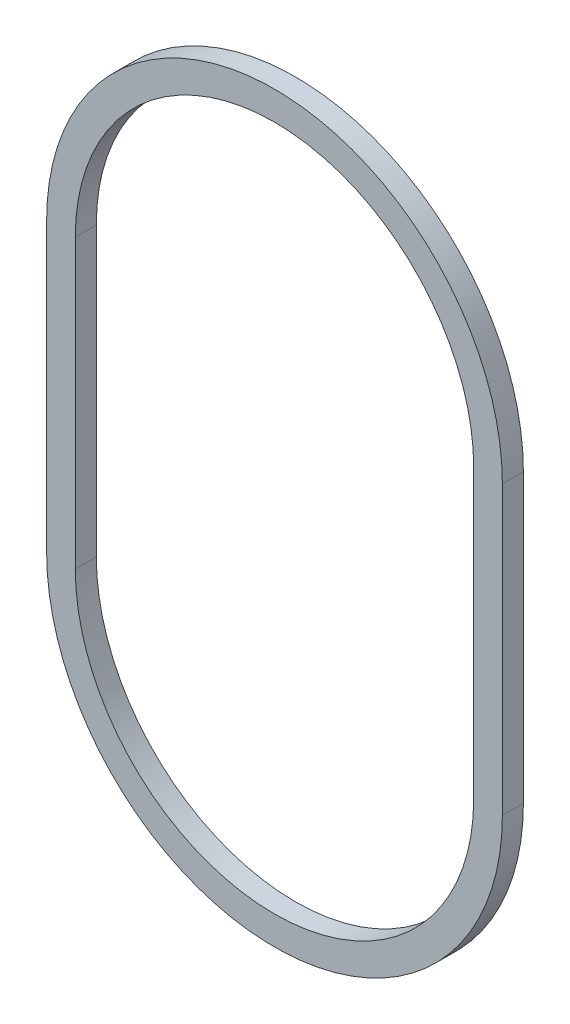
ISO-10303-21;
HEADER;
FILE_DESCRIPTION(('STEP AP214'),'2;1');
FILE_NAME('part.step','',(''),(''),'','','');
FILE_SCHEMA(('AUTOMOTIVE_DESIGN { 1 0 10303 214 1 1 1 1 }'));
ENDSEC;
DATA;
#1=APPLICATION_CONTEXT('core data for automotive mechanical design processes');
#2=APPLICATION_PROTOCOL_DEFINITION('international standard','automotive_design',2000,#1);
#3=PRODUCT_CONTEXT('',#1,'mechanical');
#4=PRODUCT('Part','Part','',(#3));
#5=PRODUCT_RELATED_PRODUCT_CATEGORY('part','',(#4));
#6=PRODUCT_DEFINITION_FORMATION('','',#4);
#7=PRODUCT_DEFINITION_CONTEXT('part definition',#1,'design');
#8=PRODUCT_DEFINITION('design','',#6,#7);
#9=PRODUCT_DEFINITION_SHAPE('','',#8);
#10=(LENGTH_UNIT() NAMED_UNIT(*) SI_UNIT(.MILLI.,.METRE.));
#11=(NAMED_UNIT(*) PLANE_ANGLE_UNIT() SI_UNIT($,.RADIAN.));
#12=(NAMED_UNIT(*) SI_UNIT($,.STERADIAN.) SOLID_ANGLE_UNIT());
#13=UNCERTAINTY_MEASURE_WITH_UNIT(LENGTH_MEASURE(1.E-05),#10,'distance_accuracy_value','');
#14=(GEOMETRIC_REPRESENTATION_CONTEXT(3) GLOBAL_UNCERTAINTY_ASSIGNED_CONTEXT((#13)) GLOBAL_UNIT_ASSIGNED_CONTEXT((#10,
#11,#12)) REPRESENTATION_CONTEXT('',''));
#15=CARTESIAN_POINT('',(0.,0.,0.));
#16=DIRECTION('',(0.,0.,1.));
#17=DIRECTION('',(1.,0.,0.));
#18=AXIS2_PLACEMENT_3D('',#15,#16,#17);
#19=CARTESIAN_POINT('',(0.,15.04,2.2));
#20=DIRECTION('',(0.,0.,1.));
#21=DIRECTION('',(1.,0.,0.));
#22=AXIS2_PLACEMENT_3D('',#19,#20,#21);
#23=PLANE('',#22);
#24=CARTESIAN_POINT('',(0.,15.04,2.2));
#25=DIRECTION('',(0.,0.,1.));
#26=DIRECTION('',(1.,0.,0.));
#27=AXIS2_PLACEMENT_3D('',#24,#25,#26);
#28=CIRCLE('',#27,23.85);
#29=CARTESIAN_POINT('',(23.85,15.04,2.2));
#30=VERTEX_POINT('',#29);
#31=CARTESIAN_POINT('',(-23.85,15.04,2.2));
#32=VERTEX_POINT('',#31);
#33=EDGE_CURVE('E134',#30,#32,#28,.T.);
#34=ORIENTED_EDGE('',*,*,#33,.T.);
#35=DIRECTION('',(0.,-1.,0.));
#36=VECTOR('',#35,1.);
#37=CARTESIAN_POINT('',(-23.85,15.04,2.2));
#38=LINE('',#37,#36);
#39=CARTESIAN_POINT('',(-23.85,-15.04,2.2));
#40=VERTEX_POINT('',#39);
#41=EDGE_CURVE('E137',#32,#40,#38,.T.);
#42=ORIENTED_EDGE('',*,*,#41,.T.);
#43=CARTESIAN_POINT('',(0.,-15.04,2.2));
#44=DIRECTION('',(0.,0.,1.));
#45=DIRECTION('',(-1.,0.,0.));
#46=AXIS2_PLACEMENT_3D('',#43,#44,#45);
#47=CIRCLE('',#46,23.85);
#48=CARTESIAN_POINT('',(23.85,-15.04,2.2));
#49=VERTEX_POINT('',#48);
#50=EDGE_CURVE('E140',#40,#49,#47,.T.);
#51=ORIENTED_EDGE('',*,*,#50,.T.);
#52=DIRECTION('',(0.,1.,0.));
#53=VECTOR('',#52,1.);
#54=CARTESIAN_POINT('',(23.85,15.04,2.2));
#55=LINE('',#54,#53);
#56=EDGE_CURVE('E142',#49,#30,#55,.T.);
#57=ORIENTED_EDGE('',*,*,#56,.T.);
#58=EDGE_LOOP('',(#34,#42,#51,#57));
#59=FACE_BOUND('',#58,.T.);
#60=DIRECTION('',(0.,-1.,0.));
#61=VECTOR('',#60,1.);
#62=CARTESIAN_POINT('',(-20.85,15.04,2.2));
#63=LINE('',#62,#61);
#64=CARTESIAN_POINT('',(-20.85,15.04,2.2));
#65=VERTEX_POINT('',#64);
#66=CARTESIAN_POINT('',(-20.85,-15.04,2.2));
#67=VERTEX_POINT('',#66);
#68=EDGE_CURVE('E106',#65,#67,#63,.T.);
#69=ORIENTED_EDGE('',*,*,#68,.F.);
#70=CARTESIAN_POINT('',(0.,15.04,2.2));
#71=DIRECTION('',(0.,0.,1.));
#72=DIRECTION('',(1.,0.,0.));
#73=AXIS2_PLACEMENT_3D('',#70,#71,#72);
#74=CIRCLE('',#73,20.85);
#75=CARTESIAN_POINT('',(20.85,15.04,2.2));
#76=VERTEX_POINT('',#75);
#77=EDGE_CURVE('E98',#76,#65,#74,.T.);
#78=ORIENTED_EDGE('',*,*,#77,.F.);
#79=DIRECTION('',(0.,1.,0.));
#80=VECTOR('',#79,1.);
#81=CARTESIAN_POINT('',(20.85,15.04,2.2));
#82=LINE('',#81,#80);
#83=CARTESIAN_POINT('',(20.85,-15.04,2.2));
#84=VERTEX_POINT('',#83);
#85=EDGE_CURVE('E120',#84,#76,#82,.T.);
#86=ORIENTED_EDGE('',*,*,#85,.F.);
#87=CARTESIAN_POINT('',(0.,-15.04,2.2));
#88=DIRECTION('',(0.,0.,1.));
#89=DIRECTION('',(-1.,0.,0.));
#90=AXIS2_PLACEMENT_3D('',#87,#88,#89);
#91=CIRCLE('',#90,20.85);
#92=EDGE_CURVE('E118',#67,#84,#91,.T.);
#93=ORIENTED_EDGE('',*,*,#92,.F.);
#94=EDGE_LOOP('',(#69,#78,#86,#93));
#95=FACE_BOUND('',#94,.T.);
#96=ADVANCED_FACE('F33',(#59,#95),#23,.T.);
#97=CARTESIAN_POINT('',(0.,15.04,0.));
#98=DIRECTION('',(0.,0.,1.));
#99=DIRECTION('',(1.,0.,0.));
#100=AXIS2_PLACEMENT_3D('',#97,#98,#99);
#101=PLANE('',#100);
#102=CARTESIAN_POINT('',(0.,15.04,0.));
#103=DIRECTION('',(0.,0.,1.));
#104=DIRECTION('',(1.,0.,0.));
#105=AXIS2_PLACEMENT_3D('',#102,#103,#104);
#106=CIRCLE('',#105,23.85);
#107=CARTESIAN_POINT('',(23.85,15.04,0.));
#108=VERTEX_POINT('',#107);
#109=CARTESIAN_POINT('',(-23.85,15.04,0.));
#110=VERTEX_POINT('',#109);
#111=EDGE_CURVE('E114',#108,#110,#106,.T.);
#112=ORIENTED_EDGE('',*,*,#111,.F.);
#113=DIRECTION('',(0.,1.,0.));
#114=VECTOR('',#113,1.);
#115=CARTESIAN_POINT('',(23.85,15.04,0.));
#116=LINE('',#115,#114);
#117=CARTESIAN_POINT('',(23.85,-15.04,0.));
#118=VERTEX_POINT('',#117);
#119=EDGE_CURVE('E138',#118,#108,#116,.T.);
#120=ORIENTED_EDGE('',*,*,#119,.F.);
#121=CARTESIAN_POINT('',(0.,-15.04,0.));
#122=DIRECTION('',(0.,0.,1.));
#123=DIRECTION('',(-1.,0.,0.));
#124=AXIS2_PLACEMENT_3D('',#121,#122,#123);
#125=CIRCLE('',#124,23.85);
#126=CARTESIAN_POINT('',(-23.85,-15.04,0.));
#127=VERTEX_POINT('',#126);
#128=EDGE_CURVE('E149',#127,#118,#125,.T.);
#129=ORIENTED_EDGE('',*,*,#128,.F.);
#130=DIRECTION('',(0.,-1.,0.));
#131=VECTOR('',#130,1.);
#132=CARTESIAN_POINT('',(-23.85,15.04,0.));
#133=LINE('',#132,#131);
#134=EDGE_CURVE('E147',#110,#127,#133,.T.);
#135=ORIENTED_EDGE('',*,*,#134,.F.);
#136=EDGE_LOOP('',(#112,#120,#129,#135));
#137=FACE_BOUND('',#136,.T.);
#138=CARTESIAN_POINT('',(0.,15.04,0.));
#139=DIRECTION('',(0.,0.,1.));
#140=DIRECTION('',(1.,0.,0.));
#141=AXIS2_PLACEMENT_3D('',#138,#139,#140);
#142=CIRCLE('',#141,20.85);
#143=CARTESIAN_POINT('',(20.85,15.04,0.));
#144=VERTEX_POINT('',#143);
#145=CARTESIAN_POINT('',(-20.85,15.04,0.));
#146=VERTEX_POINT('',#145);
#147=EDGE_CURVE('E56',#144,#146,#142,.T.);
#148=ORIENTED_EDGE('',*,*,#147,.T.);
#149=DIRECTION('',(0.,-1.,0.));
#150=VECTOR('',#149,1.);
#151=CARTESIAN_POINT('',(-20.85,15.04,0.));
#152=LINE('',#151,#150);
#153=CARTESIAN_POINT('',(-20.85,-15.04,0.));
#154=VERTEX_POINT('',#153);
#155=EDGE_CURVE('E113',#146,#154,#152,.T.);
#156=ORIENTED_EDGE('',*,*,#155,.T.);
#157=CARTESIAN_POINT('',(0.,-15.04,0.));
#158=DIRECTION('',(0.,0.,1.));
#159=DIRECTION('',(-1.,0.,0.));
#160=AXIS2_PLACEMENT_3D('',#157,#158,#159);
#161=CIRCLE('',#160,20.85);
#162=CARTESIAN_POINT('',(20.85,-15.04,0.));
#163=VERTEX_POINT('',#162);
#164=EDGE_CURVE('E126',#154,#163,#161,.T.);
#165=ORIENTED_EDGE('',*,*,#164,.T.);
#166=DIRECTION('',(0.,1.,0.));
#167=VECTOR('',#166,1.);
#168=CARTESIAN_POINT('',(20.85,15.04,0.));
#169=LINE('',#168,#167);
#170=EDGE_CURVE('E107',#163,#144,#169,.T.);
#171=ORIENTED_EDGE('',*,*,#170,.T.);
#172=EDGE_LOOP('',(#148,#156,#165,#171));
#173=FACE_BOUND('',#172,.T.);
#174=ADVANCED_FACE('F167',(#137,#173),#101,.F.);
#175=CARTESIAN_POINT('',(0.,15.04,2.2));
#176=DIRECTION('',(0.,0.,-1.));
#177=DIRECTION('',(-1.,0.,0.));
#178=AXIS2_PLACEMENT_3D('',#175,#176,#177);
#179=CYLINDRICAL_SURFACE('',#178,23.85);
#180=ORIENTED_EDGE('',*,*,#111,.T.);
#181=DIRECTION('',(0.,0.,-1.));
#182=VECTOR('',#181,1.);
#183=CARTESIAN_POINT('',(-23.85,15.04,2.2));
#184=LINE('',#183,#182);
#185=EDGE_CURVE('E11',#32,#110,#184,.T.);
#186=ORIENTED_EDGE('',*,*,#185,.F.);
#187=ORIENTED_EDGE('',*,*,#33,.F.);
#188=DIRECTION('',(0.,0.,-1.));
#189=VECTOR('',#188,1.);
#190=CARTESIAN_POINT('',(23.85,15.04,2.2));
#191=LINE('',#190,#189);
#192=EDGE_CURVE('E144',#30,#108,#191,.T.);
#193=ORIENTED_EDGE('',*,*,#192,.T.);
#194=EDGE_LOOP('',(#180,#186,#187,#193));
#195=FACE_BOUND('',#194,.T.);
#196=ADVANCED_FACE('F35',(#195),#179,.T.);
#197=CARTESIAN_POINT('',(-23.85,15.04,2.2));
#198=DIRECTION('',(1.,0.,0.));
#199=DIRECTION('',(0.,0.,-1.));
#200=AXIS2_PLACEMENT_3D('',#197,#198,#199);
#201=PLANE('',#200);
#202=ORIENTED_EDGE('',*,*,#134,.T.);
#203=DIRECTION('',(0.,0.,-1.));
#204=VECTOR('',#203,1.);
#205=CARTESIAN_POINT('',(-23.85,-15.04,2.2));
#206=LINE('',#205,#204);
#207=EDGE_CURVE('E41',#40,#127,#206,.T.);
#208=ORIENTED_EDGE('',*,*,#207,.F.);
#209=ORIENTED_EDGE('',*,*,#41,.F.);
#210=ORIENTED_EDGE('',*,*,#185,.T.);
#211=EDGE_LOOP('',(#202,#208,#209,#210));
#212=FACE_BOUND('',#211,.T.);
#213=ADVANCED_FACE('F177',(#212),#201,.F.);
#214=CARTESIAN_POINT('',(0.,-15.04,2.2));
#215=DIRECTION('',(0.,0.,-1.));
#216=DIRECTION('',(-1.,0.,0.));
#217=AXIS2_PLACEMENT_3D('',#214,#215,#216);
#218=CYLINDRICAL_SURFACE('',#217,23.85);
#219=ORIENTED_EDGE('',*,*,#128,.T.);
#220=DIRECTION('',(0.,0.,-1.));
#221=VECTOR('',#220,1.);
#222=CARTESIAN_POINT('',(23.85,-15.04,2.2));
#223=LINE('',#222,#221);
#224=EDGE_CURVE('E154',#49,#118,#223,.T.);
#225=ORIENTED_EDGE('',*,*,#224,.F.);
#226=ORIENTED_EDGE('',*,*,#50,.F.);
#227=ORIENTED_EDGE('',*,*,#207,.T.);
#228=EDGE_LOOP('',(#219,#225,#226,#227));
#229=FACE_BOUND('',#228,.T.);
#230=ADVANCED_FACE('F161',(#229),#218,.T.);
#231=CARTESIAN_POINT('',(23.85,15.04,2.2));
#232=DIRECTION('',(-1.,0.,0.));
#233=DIRECTION('',(0.,0.,1.));
#234=AXIS2_PLACEMENT_3D('',#231,#232,#233);
#235=PLANE('',#234);
#236=ORIENTED_EDGE('',*,*,#119,.T.);
#237=ORIENTED_EDGE('',*,*,#192,.F.);
#238=ORIENTED_EDGE('',*,*,#56,.F.);
#239=ORIENTED_EDGE('',*,*,#224,.T.);
#240=EDGE_LOOP('',(#236,#237,#238,#239));
#241=FACE_BOUND('',#240,.T.);
#242=ADVANCED_FACE('F171',(#241),#235,.F.);
#243=CARTESIAN_POINT('',(0.,15.04,2.2));
#244=DIRECTION('',(0.,0.,-1.));
#245=DIRECTION('',(-1.,0.,0.));
#246=AXIS2_PLACEMENT_3D('',#243,#244,#245);
#247=CYLINDRICAL_SURFACE('',#246,20.85);
#248=ORIENTED_EDGE('',*,*,#147,.F.);
#249=DIRECTION('',(0.,0.,-1.));
#250=VECTOR('',#249,1.);
#251=CARTESIAN_POINT('',(20.85,15.04,2.2));
#252=LINE('',#251,#250);
#253=EDGE_CURVE('E102',#76,#144,#252,.T.);
#254=ORIENTED_EDGE('',*,*,#253,.F.);
#255=ORIENTED_EDGE('',*,*,#77,.T.);
#256=DIRECTION('',(0.,0.,-1.));
#257=VECTOR('',#256,1.);
#258=CARTESIAN_POINT('',(-20.85,15.04,2.2));
#259=LINE('',#258,#257);
#260=EDGE_CURVE('E101',#65,#146,#259,.T.);
#261=ORIENTED_EDGE('',*,*,#260,.T.);
#262=EDGE_LOOP('',(#248,#254,#255,#261));
#263=FACE_BOUND('',#262,.T.);
#264=ADVANCED_FACE('F100',(#263),#247,.F.);
#265=CARTESIAN_POINT('',(-20.85,15.04,2.2));
#266=DIRECTION('',(1.,0.,0.));
#267=DIRECTION('',(0.,0.,-1.));
#268=AXIS2_PLACEMENT_3D('',#265,#266,#267);
#269=PLANE('',#268);
#270=ORIENTED_EDGE('',*,*,#155,.F.);
#271=ORIENTED_EDGE('',*,*,#260,.F.);
#272=ORIENTED_EDGE('',*,*,#68,.T.);
#273=DIRECTION('',(0.,0.,-1.));
#274=VECTOR('',#273,1.);
#275=CARTESIAN_POINT('',(-20.85,-15.04,2.2));
#276=LINE('',#275,#274);
#277=EDGE_CURVE('E115',#67,#154,#276,.T.);
#278=ORIENTED_EDGE('',*,*,#277,.T.);
#279=EDGE_LOOP('',(#270,#271,#272,#278));
#280=FACE_BOUND('',#279,.T.);
#281=ADVANCED_FACE('F110',(#280),#269,.T.);
#282=CARTESIAN_POINT('',(0.,-15.04,2.2));
#283=DIRECTION('',(0.,0.,-1.));
#284=DIRECTION('',(-1.,0.,0.));
#285=AXIS2_PLACEMENT_3D('',#282,#283,#284);
#286=CYLINDRICAL_SURFACE('',#285,20.85);
#287=ORIENTED_EDGE('',*,*,#164,.F.);
#288=ORIENTED_EDGE('',*,*,#277,.F.);
#289=ORIENTED_EDGE('',*,*,#92,.T.);
#290=DIRECTION('',(0.,0.,-1.));
#291=VECTOR('',#290,1.);
#292=CARTESIAN_POINT('',(20.85,-15.04,2.2));
#293=LINE('',#292,#291);
#294=EDGE_CURVE('E48',#84,#163,#293,.T.);
#295=ORIENTED_EDGE('',*,*,#294,.T.);
#296=EDGE_LOOP('',(#287,#288,#289,#295));
#297=FACE_BOUND('',#296,.T.);
#298=ADVANCED_FACE('F200',(#297),#286,.F.);
#299=CARTESIAN_POINT('',(20.85,15.04,2.2));
#300=DIRECTION('',(-1.,0.,0.));
#301=DIRECTION('',(0.,0.,1.));
#302=AXIS2_PLACEMENT_3D('',#299,#300,#301);
#303=PLANE('',#302);
#304=ORIENTED_EDGE('',*,*,#170,.F.);
#305=ORIENTED_EDGE('',*,*,#294,.F.);
#306=ORIENTED_EDGE('',*,*,#85,.T.);
#307=ORIENTED_EDGE('',*,*,#253,.T.);
#308=EDGE_LOOP('',(#304,#305,#306,#307));
#309=FACE_BOUND('',#308,.T.);
#310=ADVANCED_FACE('F204',(#309),#303,.T.);
#311=CLOSED_SHELL('',(#96,#174,#196,#213,#230,#242,#264,#281,#298,#310));
#312=MANIFOLD_SOLID_BREP('B2',#311);
#313=ADVANCED_BREP_SHAPE_REPRESENTATION('',(#18,#312),#14);
#314=SHAPE_DEFINITION_REPRESENTATION(#9,#313);
ENDSEC;
END-ISO-10303-21;
